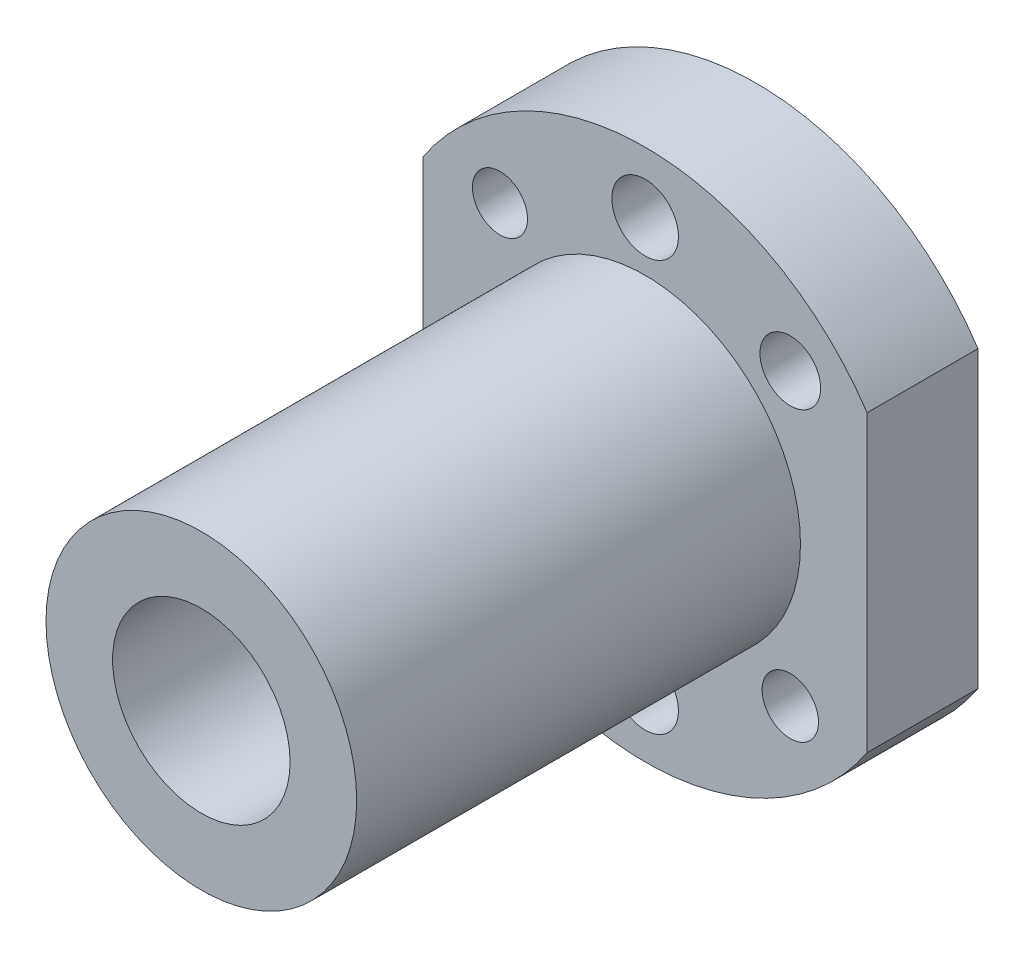
ISO-10303-21;
HEADER;
FILE_DESCRIPTION(('STEP AP214'),'2;1');
FILE_NAME('part.step','',(''),(''),'','','');
FILE_SCHEMA(('AUTOMOTIVE_DESIGN { 1 0 10303 214 1 1 1 1 }'));
ENDSEC;
DATA;
#1=APPLICATION_CONTEXT('core data for automotive mechanical design processes');
#2=APPLICATION_PROTOCOL_DEFINITION('international standard','automotive_design',2000,#1);
#3=PRODUCT_CONTEXT('',#1,'mechanical');
#4=PRODUCT('Part','Part','',(#3));
#5=PRODUCT_RELATED_PRODUCT_CATEGORY('part','',(#4));
#6=PRODUCT_DEFINITION_FORMATION('','',#4);
#7=PRODUCT_DEFINITION_CONTEXT('part definition',#1,'design');
#8=PRODUCT_DEFINITION('design','',#6,#7);
#9=PRODUCT_DEFINITION_SHAPE('','',#8);
#10=(LENGTH_UNIT() NAMED_UNIT(*) SI_UNIT(.MILLI.,.METRE.));
#11=(NAMED_UNIT(*) PLANE_ANGLE_UNIT() SI_UNIT($,.RADIAN.));
#12=(NAMED_UNIT(*) SI_UNIT($,.STERADIAN.) SOLID_ANGLE_UNIT());
#13=UNCERTAINTY_MEASURE_WITH_UNIT(LENGTH_MEASURE(1.E-05),#10,'distance_accuracy_value','');
#14=(GEOMETRIC_REPRESENTATION_CONTEXT(3) GLOBAL_UNCERTAINTY_ASSIGNED_CONTEXT((#13)) GLOBAL_UNIT_ASSIGNED_CONTEXT((#10,
#11,#12)) REPRESENTATION_CONTEXT('',''));
#15=CARTESIAN_POINT('',(0.,0.,0.));
#16=DIRECTION('',(0.,0.,1.));
#17=DIRECTION('',(1.,0.,0.));
#18=AXIS2_PLACEMENT_3D('',#15,#16,#17);
#19=CARTESIAN_POINT('',(0.,0.,10.));
#20=DIRECTION('',(0.,0.,-1.));
#21=DIRECTION('',(-1.,0.,0.));
#22=AXIS2_PLACEMENT_3D('',#19,#20,#21);
#23=CYLINDRICAL_SURFACE('',#22,24.);
#24=CARTESIAN_POINT('',(0.,0.,10.));
#25=DIRECTION('',(0.,0.,1.));
#26=DIRECTION('',(1.,0.,0.));
#27=AXIS2_PLACEMENT_3D('',#24,#25,#26);
#28=CIRCLE('',#27,24.);
#29=CARTESIAN_POINT('',(-20.,-13.2664991614216,10.));
#30=VERTEX_POINT('',#29);
#31=CARTESIAN_POINT('',(20.,-13.2664991614216,10.));
#32=VERTEX_POINT('',#31);
#33=EDGE_CURVE('E48',#30,#32,#28,.T.);
#34=ORIENTED_EDGE('',*,*,#33,.F.);
#35=DIRECTION('',(0.,0.,-1.));
#36=VECTOR('',#35,1.);
#37=CARTESIAN_POINT('',(-20.,-13.2664991614216,10.));
#38=LINE('',#37,#36);
#39=CARTESIAN_POINT('',(-20.,-13.2664991614216,0.));
#40=VERTEX_POINT('',#39);
#41=EDGE_CURVE('E83',#30,#40,#38,.T.);
#42=ORIENTED_EDGE('',*,*,#41,.T.);
#43=CARTESIAN_POINT('',(0.,0.,0.));
#44=DIRECTION('',(0.,0.,1.));
#45=DIRECTION('',(1.,0.,0.));
#46=AXIS2_PLACEMENT_3D('',#43,#44,#45);
#47=CIRCLE('',#46,24.);
#48=CARTESIAN_POINT('',(20.,-13.2664991614216,0.));
#49=VERTEX_POINT('',#48);
#50=EDGE_CURVE('E63',#40,#49,#47,.T.);
#51=ORIENTED_EDGE('',*,*,#50,.T.);
#52=DIRECTION('',(0.,0.,-1.));
#53=VECTOR('',#52,1.);
#54=CARTESIAN_POINT('',(20.,-13.2664991614216,10.));
#55=LINE('',#54,#53);
#56=EDGE_CURVE('E100',#32,#49,#55,.T.);
#57=ORIENTED_EDGE('',*,*,#56,.F.);
#58=EDGE_LOOP('',(#34,#42,#51,#57));
#59=FACE_BOUND('',#58,.T.);
#60=ADVANCED_FACE('F39',(#59),#23,.T.);
#61=CARTESIAN_POINT('',(0.,0.,10.));
#62=DIRECTION('',(0.,0.,1.));
#63=DIRECTION('',(1.,0.,0.));
#64=AXIS2_PLACEMENT_3D('',#61,#62,#63);
#65=PLANE('',#64);
#66=CARTESIAN_POINT('',(13.0836978015893,13.0836978015893,10.));
#67=DIRECTION('',(0.,0.,-1.));
#68=DIRECTION('',(-1.,0.,0.));
#69=AXIS2_PLACEMENT_3D('',#66,#67,#68);
#70=CIRCLE('',#69,2.73270173526558);
#71=CARTESIAN_POINT('',(10.3509960663237,13.0836978015893,10.));
#72=VERTEX_POINT('',#71);
#73=EDGE_CURVE('E190',#72,#72,#70,.T.);
#74=ORIENTED_EDGE('',*,*,#73,.T.);
#75=EDGE_LOOP('',(#74));
#76=FACE_BOUND('',#75,.T.);
#77=CARTESIAN_POINT('',(13.0836978015893,-13.0836978015893,10.));
#78=DIRECTION('',(0.,0.,-1.));
#79=DIRECTION('',(-1.,0.,0.));
#80=AXIS2_PLACEMENT_3D('',#77,#78,#79);
#81=CIRCLE('',#80,2.54283436814933);
#82=CARTESIAN_POINT('',(10.54086343344,-13.0836978015893,10.));
#83=VERTEX_POINT('',#82);
#84=EDGE_CURVE('E186',#83,#83,#81,.T.);
#85=ORIENTED_EDGE('',*,*,#84,.T.);
#86=EDGE_LOOP('',(#85));
#87=FACE_BOUND('',#86,.T.);
#88=CARTESIAN_POINT('',(0.,-18.5031428769986,10.));
#89=DIRECTION('',(0.,0.,-1.));
#90=DIRECTION('',(-1.,0.,0.));
#91=AXIS2_PLACEMENT_3D('',#88,#89,#90);
#92=CIRCLE('',#91,3.);
#93=CARTESIAN_POINT('',(-3.,-18.5031428769986,10.));
#94=VERTEX_POINT('',#93);
#95=EDGE_CURVE('E182',#94,#94,#92,.T.);
#96=ORIENTED_EDGE('',*,*,#95,.T.);
#97=EDGE_LOOP('',(#96));
#98=FACE_BOUND('',#97,.T.);
#99=CARTESIAN_POINT('',(-13.0836978015893,-13.0836978015893,10.));
#100=DIRECTION('',(0.,0.,-1.));
#101=DIRECTION('',(-1.,0.,0.));
#102=AXIS2_PLACEMENT_3D('',#99,#100,#101);
#103=CIRCLE('',#102,3.08237974349155);
#104=CARTESIAN_POINT('',(-16.1660775450809,-13.0836978015893,10.));
#105=VERTEX_POINT('',#104);
#106=EDGE_CURVE('E178',#105,#105,#103,.T.);
#107=ORIENTED_EDGE('',*,*,#106,.T.);
#108=EDGE_LOOP('',(#107));
#109=FACE_BOUND('',#108,.T.);
#110=CARTESIAN_POINT('',(-13.0836978015893,13.0836978015893,10.));
#111=DIRECTION('',(0.,0.,-1.));
#112=DIRECTION('',(-1.,0.,0.));
#113=AXIS2_PLACEMENT_3D('',#110,#111,#112);
#114=CIRCLE('',#113,2.48129436958041);
#115=CARTESIAN_POINT('',(-15.5649921711697,13.0836978015893,10.));
#116=VERTEX_POINT('',#115);
#117=EDGE_CURVE('E174',#116,#116,#114,.T.);
#118=ORIENTED_EDGE('',*,*,#117,.T.);
#119=EDGE_LOOP('',(#118));
#120=FACE_BOUND('',#119,.T.);
#121=CARTESIAN_POINT('',(0.,18.5031428769986,10.));
#122=DIRECTION('',(0.,0.,-1.));
#123=DIRECTION('',(-1.,0.,0.));
#124=AXIS2_PLACEMENT_3D('',#121,#122,#123);
#125=CIRCLE('',#124,3.);
#126=CARTESIAN_POINT('',(-3.,18.5031428769986,10.));
#127=VERTEX_POINT('',#126);
#128=EDGE_CURVE('E171',#127,#127,#125,.T.);
#129=ORIENTED_EDGE('',*,*,#128,.T.);
#130=EDGE_LOOP('',(#129));
#131=FACE_BOUND('',#130,.T.);
#132=DIRECTION('',(0.,-1.,0.));
#133=VECTOR('',#132,1.);
#134=CARTESIAN_POINT('',(-20.,13.2664991614216,10.));
#135=LINE('',#134,#133);
#136=CARTESIAN_POINT('',(-20.,13.2664991614216,10.));
#137=VERTEX_POINT('',#136);
#138=EDGE_CURVE('E81',#137,#30,#135,.T.);
#139=ORIENTED_EDGE('',*,*,#138,.T.);
#140=ORIENTED_EDGE('',*,*,#33,.T.);
#141=DIRECTION('',(0.,1.,0.));
#142=VECTOR('',#141,1.);
#143=CARTESIAN_POINT('',(20.,13.2664991614216,10.));
#144=LINE('',#143,#142);
#145=CARTESIAN_POINT('',(20.,13.2664991614216,10.));
#146=VERTEX_POINT('',#145);
#147=EDGE_CURVE('E98',#32,#146,#144,.T.);
#148=ORIENTED_EDGE('',*,*,#147,.T.);
#149=EDGE_CURVE('E11',#146,#137,#28,.T.);
#150=ORIENTED_EDGE('',*,*,#149,.T.);
#151=EDGE_LOOP('',(#139,#140,#148,#150));
#152=FACE_BOUND('',#151,.T.);
#153=CARTESIAN_POINT('',(0.,0.,10.));
#154=DIRECTION('',(0.,0.,1.));
#155=DIRECTION('',(1.,0.,0.));
#156=AXIS2_PLACEMENT_3D('',#153,#154,#155);
#157=CIRCLE('',#156,14.);
#158=CARTESIAN_POINT('',(14.,0.,10.));
#159=VERTEX_POINT('',#158);
#160=EDGE_CURVE('E113',#159,#159,#157,.T.);
#161=ORIENTED_EDGE('',*,*,#160,.F.);
#162=EDGE_LOOP('',(#161));
#163=FACE_BOUND('',#162,.T.);
#164=ADVANCED_FACE('F95',(#76,#87,#98,#109,#120,#131,#152,#163),#65,.T.);
#165=CARTESIAN_POINT('',(20.,13.2664991614216,0.));
#166=VERTEX_POINT('',#165);
#167=CARTESIAN_POINT('',(-20.,13.2664991614216,0.));
#168=VERTEX_POINT('',#167);
#169=EDGE_CURVE('E43',#166,#168,#47,.T.);
#170=ORIENTED_EDGE('',*,*,#169,.T.);
#171=DIRECTION('',(0.,0.,-1.));
#172=VECTOR('',#171,1.);
#173=CARTESIAN_POINT('',(-20.,13.2664991614216,10.));
#174=LINE('',#173,#172);
#175=EDGE_CURVE('E55',#137,#168,#174,.T.);
#176=ORIENTED_EDGE('',*,*,#175,.F.);
#177=ORIENTED_EDGE('',*,*,#149,.F.);
#178=DIRECTION('',(0.,0.,-1.));
#179=VECTOR('',#178,1.);
#180=CARTESIAN_POINT('',(20.,13.2664991614216,10.));
#181=LINE('',#180,#179);
#182=EDGE_CURVE('E103',#146,#166,#181,.T.);
#183=ORIENTED_EDGE('',*,*,#182,.T.);
#184=EDGE_LOOP('',(#170,#176,#177,#183));
#185=FACE_BOUND('',#184,.T.);
#186=ADVANCED_FACE('F41',(#185),#23,.T.);
#187=CARTESIAN_POINT('',(0.,0.,0.));
#188=DIRECTION('',(0.,0.,1.));
#189=DIRECTION('',(1.,0.,0.));
#190=AXIS2_PLACEMENT_3D('',#187,#188,#189);
#191=PLANE('',#190);
#192=CARTESIAN_POINT('',(13.0836978015893,13.0836978015893,0.));
#193=DIRECTION('',(0.,0.,-1.));
#194=DIRECTION('',(-1.,0.,0.));
#195=AXIS2_PLACEMENT_3D('',#192,#193,#194);
#196=CIRCLE('',#195,2.73270173526558);
#197=CARTESIAN_POINT('',(10.3509960663237,13.0836978015893,0.));
#198=VERTEX_POINT('',#197);
#199=EDGE_CURVE('E145',#198,#198,#196,.T.);
#200=ORIENTED_EDGE('',*,*,#199,.F.);
#201=EDGE_LOOP('',(#200));
#202=FACE_BOUND('',#201,.T.);
#203=CARTESIAN_POINT('',(13.0836978015893,-13.0836978015893,0.));
#204=DIRECTION('',(0.,0.,-1.));
#205=DIRECTION('',(-1.,0.,0.));
#206=AXIS2_PLACEMENT_3D('',#203,#204,#205);
#207=CIRCLE('',#206,2.54283436814933);
#208=CARTESIAN_POINT('',(10.54086343344,-13.0836978015893,0.));
#209=VERTEX_POINT('',#208);
#210=EDGE_CURVE('E149',#209,#209,#207,.T.);
#211=ORIENTED_EDGE('',*,*,#210,.F.);
#212=EDGE_LOOP('',(#211));
#213=FACE_BOUND('',#212,.T.);
#214=CARTESIAN_POINT('',(0.,-18.5031428769986,0.));
#215=DIRECTION('',(0.,0.,-1.));
#216=DIRECTION('',(-1.,0.,0.));
#217=AXIS2_PLACEMENT_3D('',#214,#215,#216);
#218=CIRCLE('',#217,3.);
#219=CARTESIAN_POINT('',(-3.,-18.5031428769986,0.));
#220=VERTEX_POINT('',#219);
#221=EDGE_CURVE('E153',#220,#220,#218,.T.);
#222=ORIENTED_EDGE('',*,*,#221,.F.);
#223=EDGE_LOOP('',(#222));
#224=FACE_BOUND('',#223,.T.);
#225=CARTESIAN_POINT('',(-13.0836978015893,-13.0836978015893,0.));
#226=DIRECTION('',(0.,0.,-1.));
#227=DIRECTION('',(-1.,0.,0.));
#228=AXIS2_PLACEMENT_3D('',#225,#226,#227);
#229=CIRCLE('',#228,3.08237974349155);
#230=CARTESIAN_POINT('',(-16.1660775450809,-13.0836978015893,0.));
#231=VERTEX_POINT('',#230);
#232=EDGE_CURVE('E157',#231,#231,#229,.T.);
#233=ORIENTED_EDGE('',*,*,#232,.F.);
#234=EDGE_LOOP('',(#233));
#235=FACE_BOUND('',#234,.T.);
#236=CARTESIAN_POINT('',(-13.0836978015893,13.0836978015893,0.));
#237=DIRECTION('',(0.,0.,-1.));
#238=DIRECTION('',(-1.,0.,0.));
#239=AXIS2_PLACEMENT_3D('',#236,#237,#238);
#240=CIRCLE('',#239,2.48129436958041);
#241=CARTESIAN_POINT('',(-15.5649921711697,13.0836978015893,0.));
#242=VERTEX_POINT('',#241);
#243=EDGE_CURVE('E161',#242,#242,#240,.T.);
#244=ORIENTED_EDGE('',*,*,#243,.F.);
#245=EDGE_LOOP('',(#244));
#246=FACE_BOUND('',#245,.T.);
#247=CARTESIAN_POINT('',(0.,18.5031428769986,0.));
#248=DIRECTION('',(0.,0.,-1.));
#249=DIRECTION('',(-1.,0.,0.));
#250=AXIS2_PLACEMENT_3D('',#247,#248,#249);
#251=CIRCLE('',#250,3.);
#252=CARTESIAN_POINT('',(-3.,18.5031428769986,0.));
#253=VERTEX_POINT('',#252);
#254=EDGE_CURVE('E165',#253,#253,#251,.T.);
#255=ORIENTED_EDGE('',*,*,#254,.F.);
#256=EDGE_LOOP('',(#255));
#257=FACE_BOUND('',#256,.T.);
#258=CARTESIAN_POINT('',(0.,0.,0.));
#259=DIRECTION('',(0.,0.,1.));
#260=DIRECTION('',(1.,0.,0.));
#261=AXIS2_PLACEMENT_3D('',#258,#259,#260);
#262=CIRCLE('',#261,8.);
#263=CARTESIAN_POINT('',(8.,0.,0.));
#264=VERTEX_POINT('',#263);
#265=EDGE_CURVE('E110',#264,#264,#262,.T.);
#266=ORIENTED_EDGE('',*,*,#265,.T.);
#267=EDGE_LOOP('',(#266));
#268=FACE_BOUND('',#267,.T.);
#269=ORIENTED_EDGE('',*,*,#50,.F.);
#270=DIRECTION('',(0.,-1.,0.));
#271=VECTOR('',#270,1.);
#272=CARTESIAN_POINT('',(-20.,13.2664991614216,0.));
#273=LINE('',#272,#271);
#274=EDGE_CURVE('E86',#168,#40,#273,.T.);
#275=ORIENTED_EDGE('',*,*,#274,.F.);
#276=ORIENTED_EDGE('',*,*,#169,.F.);
#277=DIRECTION('',(0.,1.,0.));
#278=VECTOR('',#277,1.);
#279=CARTESIAN_POINT('',(20.,13.2664991614216,0.));
#280=LINE('',#279,#278);
#281=EDGE_CURVE('E101',#49,#166,#280,.T.);
#282=ORIENTED_EDGE('',*,*,#281,.F.);
#283=EDGE_LOOP('',(#269,#275,#276,#282));
#284=FACE_BOUND('',#283,.T.);
#285=ADVANCED_FACE('F130',(#202,#213,#224,#235,#246,#257,#268,#284),#191,.F.);
#286=CARTESIAN_POINT('',(0.,0.,50.));
#287=DIRECTION('',(0.,0.,-1.));
#288=DIRECTION('',(-1.,0.,0.));
#289=AXIS2_PLACEMENT_3D('',#286,#287,#288);
#290=CYLINDRICAL_SURFACE('',#289,14.);
#291=CARTESIAN_POINT('',(0.,0.,50.));
#292=DIRECTION('',(0.,0.,1.));
#293=DIRECTION('',(1.,0.,0.));
#294=AXIS2_PLACEMENT_3D('',#291,#292,#293);
#295=CIRCLE('',#294,14.);
#296=CARTESIAN_POINT('',(14.,0.,50.));
#297=VERTEX_POINT('',#296);
#298=EDGE_CURVE('E116',#297,#297,#295,.T.);
#299=ORIENTED_EDGE('',*,*,#298,.F.);
#300=EDGE_LOOP('',(#299));
#301=FACE_BOUND('',#300,.T.);
#302=ORIENTED_EDGE('',*,*,#160,.T.);
#303=EDGE_LOOP('',(#302));
#304=FACE_BOUND('',#303,.T.);
#305=ADVANCED_FACE('F122',(#301,#304),#290,.T.);
#306=CARTESIAN_POINT('',(0.,0.,50.));
#307=DIRECTION('',(0.,0.,1.));
#308=DIRECTION('',(1.,0.,0.));
#309=AXIS2_PLACEMENT_3D('',#306,#307,#308);
#310=PLANE('',#309);
#311=CARTESIAN_POINT('',(0.,0.,50.));
#312=DIRECTION('',(0.,0.,1.));
#313=DIRECTION('',(1.,0.,0.));
#314=AXIS2_PLACEMENT_3D('',#311,#312,#313);
#315=CIRCLE('',#314,8.);
#316=CARTESIAN_POINT('',(8.,0.,50.));
#317=VERTEX_POINT('',#316);
#318=EDGE_CURVE('E108',#317,#317,#315,.T.);
#319=ORIENTED_EDGE('',*,*,#318,.F.);
#320=EDGE_LOOP('',(#319));
#321=FACE_BOUND('',#320,.T.);
#322=ORIENTED_EDGE('',*,*,#298,.T.);
#323=EDGE_LOOP('',(#322));
#324=FACE_BOUND('',#323,.T.);
#325=ADVANCED_FACE('F140',(#321,#324),#310,.T.);
#326=CARTESIAN_POINT('',(0.,0.,0.));
#327=DIRECTION('',(0.,0.,1.));
#328=DIRECTION('',(1.,0.,0.));
#329=AXIS2_PLACEMENT_3D('',#326,#327,#328);
#330=CYLINDRICAL_SURFACE('',#329,8.);
#331=ORIENTED_EDGE('',*,*,#265,.F.);
#332=EDGE_LOOP('',(#331));
#333=FACE_BOUND('',#332,.T.);
#334=ORIENTED_EDGE('',*,*,#318,.T.);
#335=EDGE_LOOP('',(#334));
#336=FACE_BOUND('',#335,.T.);
#337=ADVANCED_FACE('F227',(#333,#336),#330,.F.);
#338=CARTESIAN_POINT('',(20.,13.2664991614216,10.));
#339=DIRECTION('',(-1.,0.,0.));
#340=DIRECTION('',(0.,-1.,0.));
#341=AXIS2_PLACEMENT_3D('',#338,#339,#340);
#342=PLANE('',#341);
#343=ORIENTED_EDGE('',*,*,#281,.T.);
#344=ORIENTED_EDGE('',*,*,#182,.F.);
#345=ORIENTED_EDGE('',*,*,#147,.F.);
#346=ORIENTED_EDGE('',*,*,#56,.T.);
#347=EDGE_LOOP('',(#343,#344,#345,#346));
#348=FACE_BOUND('',#347,.T.);
#349=ADVANCED_FACE('F169',(#348),#342,.F.);
#350=CARTESIAN_POINT('',(-20.,13.2664991614216,10.));
#351=DIRECTION('',(1.,0.,0.));
#352=DIRECTION('',(0.,0.,-1.));
#353=AXIS2_PLACEMENT_3D('',#350,#351,#352);
#354=PLANE('',#353);
#355=ORIENTED_EDGE('',*,*,#274,.T.);
#356=ORIENTED_EDGE('',*,*,#41,.F.);
#357=ORIENTED_EDGE('',*,*,#138,.F.);
#358=ORIENTED_EDGE('',*,*,#175,.T.);
#359=EDGE_LOOP('',(#355,#356,#357,#358));
#360=FACE_BOUND('',#359,.T.);
#361=ADVANCED_FACE('F82',(#360),#354,.F.);
#362=CARTESIAN_POINT('',(0.,18.5031428769986,10.));
#363=DIRECTION('',(0.,0.,-1.));
#364=DIRECTION('',(-1.,0.,0.));
#365=AXIS2_PLACEMENT_3D('',#362,#363,#364);
#366=CYLINDRICAL_SURFACE('',#365,3.);
#367=ORIENTED_EDGE('',*,*,#128,.F.);
#368=EDGE_LOOP('',(#367));
#369=FACE_BOUND('',#368,.T.);
#370=ORIENTED_EDGE('',*,*,#254,.T.);
#371=EDGE_LOOP('',(#370));
#372=FACE_BOUND('',#371,.T.);
#373=ADVANCED_FACE('F218',(#369,#372),#366,.F.);
#374=CARTESIAN_POINT('',(-13.0836978015893,13.0836978015893,10.));
#375=DIRECTION('',(0.,0.,-1.));
#376=DIRECTION('',(-1.,0.,0.));
#377=AXIS2_PLACEMENT_3D('',#374,#375,#376);
#378=CYLINDRICAL_SURFACE('',#377,2.48129436958041);
#379=ORIENTED_EDGE('',*,*,#117,.F.);
#380=EDGE_LOOP('',(#379));
#381=FACE_BOUND('',#380,.T.);
#382=ORIENTED_EDGE('',*,*,#243,.T.);
#383=EDGE_LOOP('',(#382));
#384=FACE_BOUND('',#383,.T.);
#385=ADVANCED_FACE('F214',(#381,#384),#378,.F.);
#386=CARTESIAN_POINT('',(-13.0836978015893,-13.0836978015893,10.));
#387=DIRECTION('',(0.,0.,-1.));
#388=DIRECTION('',(-1.,0.,0.));
#389=AXIS2_PLACEMENT_3D('',#386,#387,#388);
#390=CYLINDRICAL_SURFACE('',#389,3.08237974349155);
#391=ORIENTED_EDGE('',*,*,#106,.F.);
#392=EDGE_LOOP('',(#391));
#393=FACE_BOUND('',#392,.T.);
#394=ORIENTED_EDGE('',*,*,#232,.T.);
#395=EDGE_LOOP('',(#394));
#396=FACE_BOUND('',#395,.T.);
#397=ADVANCED_FACE('F210',(#393,#396),#390,.F.);
#398=CARTESIAN_POINT('',(0.,-18.5031428769986,10.));
#399=DIRECTION('',(0.,0.,-1.));
#400=DIRECTION('',(-1.,0.,0.));
#401=AXIS2_PLACEMENT_3D('',#398,#399,#400);
#402=CYLINDRICAL_SURFACE('',#401,3.);
#403=ORIENTED_EDGE('',*,*,#95,.F.);
#404=EDGE_LOOP('',(#403));
#405=FACE_BOUND('',#404,.T.);
#406=ORIENTED_EDGE('',*,*,#221,.T.);
#407=EDGE_LOOP('',(#406));
#408=FACE_BOUND('',#407,.T.);
#409=ADVANCED_FACE('F204',(#405,#408),#402,.F.);
#410=CARTESIAN_POINT('',(13.0836978015893,-13.0836978015893,10.));
#411=DIRECTION('',(0.,0.,-1.));
#412=DIRECTION('',(-1.,0.,0.));
#413=AXIS2_PLACEMENT_3D('',#410,#411,#412);
#414=CYLINDRICAL_SURFACE('',#413,2.54283436814933);
#415=ORIENTED_EDGE('',*,*,#84,.F.);
#416=EDGE_LOOP('',(#415));
#417=FACE_BOUND('',#416,.T.);
#418=ORIENTED_EDGE('',*,*,#210,.T.);
#419=EDGE_LOOP('',(#418));
#420=FACE_BOUND('',#419,.T.);
#421=ADVANCED_FACE('F199',(#417,#420),#414,.F.);
#422=CARTESIAN_POINT('',(13.0836978015893,13.0836978015893,10.));
#423=DIRECTION('',(0.,0.,-1.));
#424=DIRECTION('',(-1.,0.,0.));
#425=AXIS2_PLACEMENT_3D('',#422,#423,#424);
#426=CYLINDRICAL_SURFACE('',#425,2.73270173526558);
#427=ORIENTED_EDGE('',*,*,#73,.F.);
#428=EDGE_LOOP('',(#427));
#429=FACE_BOUND('',#428,.T.);
#430=ORIENTED_EDGE('',*,*,#199,.T.);
#431=EDGE_LOOP('',(#430));
#432=FACE_BOUND('',#431,.T.);
#433=ADVANCED_FACE('F196',(#429,#432),#426,.F.);
#434=CLOSED_SHELL('',(#60,#164,#186,#285,#305,#325,#337,#349,#361,#373,#385,#397,#409,#421,#433));
#435=MANIFOLD_SOLID_BREP('B2',#434);
#436=ADVANCED_BREP_SHAPE_REPRESENTATION('',(#18,#435),#14);
#437=SHAPE_DEFINITION_REPRESENTATION(#9,#436);
ENDSEC;
END-ISO-10303-21;
